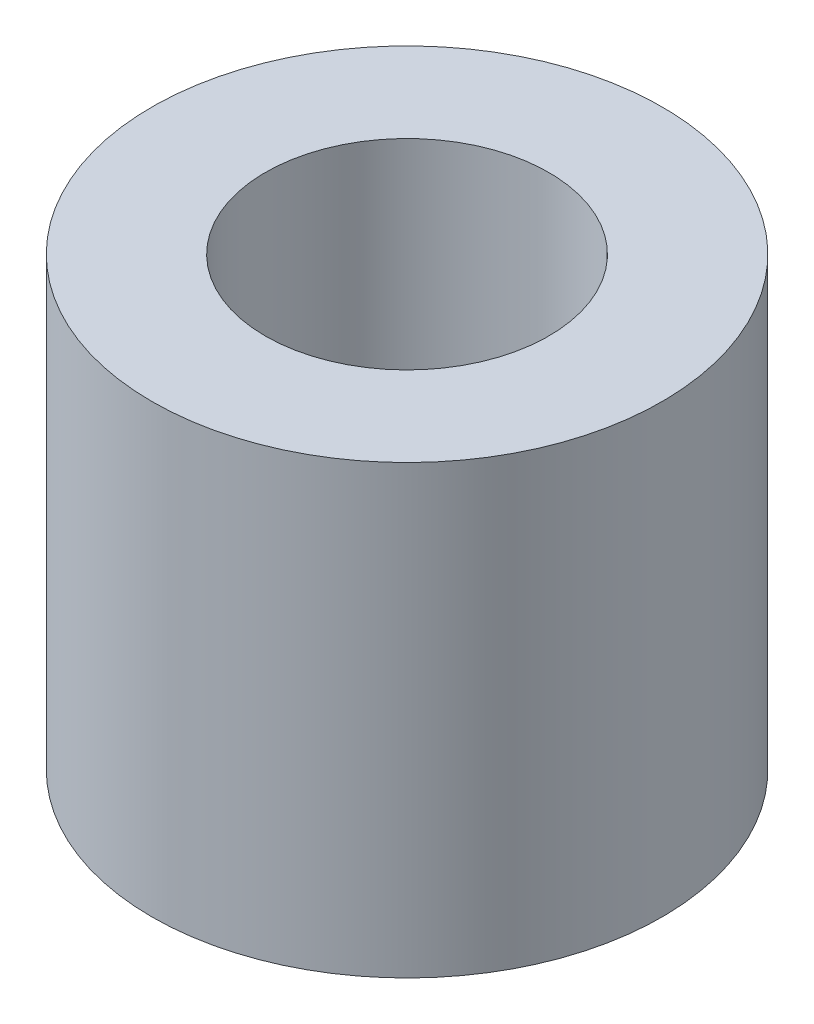
ISO-10303-21;
HEADER;
FILE_DESCRIPTION(('STEP AP214'),'2;1');
FILE_NAME('part.step','',(''),(''),'','','');
FILE_SCHEMA(('AUTOMOTIVE_DESIGN { 1 0 10303 214 1 1 1 1 }'));
ENDSEC;
DATA;
#1=APPLICATION_CONTEXT('core data for automotive mechanical design processes');
#2=APPLICATION_PROTOCOL_DEFINITION('international standard','automotive_design',2000,#1);
#3=PRODUCT_CONTEXT('',#1,'mechanical');
#4=PRODUCT('Part','Part','',(#3));
#5=PRODUCT_RELATED_PRODUCT_CATEGORY('part','',(#4));
#6=PRODUCT_DEFINITION_FORMATION('','',#4);
#7=PRODUCT_DEFINITION_CONTEXT('part definition',#1,'design');
#8=PRODUCT_DEFINITION('design','',#6,#7);
#9=PRODUCT_DEFINITION_SHAPE('','',#8);
#10=(LENGTH_UNIT() NAMED_UNIT(*) SI_UNIT(.MILLI.,.METRE.));
#11=(NAMED_UNIT(*) PLANE_ANGLE_UNIT() SI_UNIT($,.RADIAN.));
#12=(NAMED_UNIT(*) SI_UNIT($,.STERADIAN.) SOLID_ANGLE_UNIT());
#13=UNCERTAINTY_MEASURE_WITH_UNIT(LENGTH_MEASURE(1.E-05),#10,'distance_accuracy_value','');
#14=(GEOMETRIC_REPRESENTATION_CONTEXT(3) GLOBAL_UNCERTAINTY_ASSIGNED_CONTEXT((#13)) GLOBAL_UNIT_ASSIGNED_CONTEXT((#10,
#11,#12)) REPRESENTATION_CONTEXT('',''));
#15=CARTESIAN_POINT('',(0.,0.,0.));
#16=DIRECTION('',(0.,0.,1.));
#17=DIRECTION('',(1.,0.,0.));
#18=AXIS2_PLACEMENT_3D('',#15,#16,#17);
#19=CARTESIAN_POINT('',(0.,10.,0.));
#20=DIRECTION('',(0.,1.,0.));
#21=DIRECTION('',(0.,0.,1.));
#22=AXIS2_PLACEMENT_3D('',#19,#20,#21);
#23=PLANE('',#22);
#24=CARTESIAN_POINT('',(0.,10.,0.));
#25=DIRECTION('',(0.,1.,0.));
#26=DIRECTION('',(0.,0.,1.));
#27=AXIS2_PLACEMENT_3D('',#24,#25,#26);
#28=CIRCLE('',#27,5.715);
#29=CARTESIAN_POINT('',(0.,10.,5.715));
#30=VERTEX_POINT('',#29);
#31=EDGE_CURVE('E10',#30,#30,#28,.T.);
#32=ORIENTED_EDGE('',*,*,#31,.T.);
#33=EDGE_LOOP('',(#32));
#34=FACE_BOUND('',#33,.T.);
#35=CARTESIAN_POINT('',(0.,10.,0.));
#36=DIRECTION('',(0.,1.,0.));
#37=DIRECTION('',(0.,0.,1.));
#38=AXIS2_PLACEMENT_3D('',#35,#36,#37);
#39=CIRCLE('',#38,3.175);
#40=CARTESIAN_POINT('',(0.,10.,3.175));
#41=VERTEX_POINT('',#40);
#42=EDGE_CURVE('E46',#41,#41,#39,.T.);
#43=ORIENTED_EDGE('',*,*,#42,.F.);
#44=EDGE_LOOP('',(#43));
#45=FACE_BOUND('',#44,.T.);
#46=ADVANCED_FACE('F35',(#34,#45),#23,.T.);
#47=CARTESIAN_POINT('',(0.,0.,0.));
#48=DIRECTION('',(0.,1.,0.));
#49=DIRECTION('',(0.,0.,1.));
#50=AXIS2_PLACEMENT_3D('',#47,#48,#49);
#51=PLANE('',#50);
#52=CARTESIAN_POINT('',(0.,0.,0.));
#53=DIRECTION('',(0.,1.,0.));
#54=DIRECTION('',(0.,0.,1.));
#55=AXIS2_PLACEMENT_3D('',#52,#53,#54);
#56=CIRCLE('',#55,5.715);
#57=CARTESIAN_POINT('',(0.,0.,5.715));
#58=VERTEX_POINT('',#57);
#59=EDGE_CURVE('E39',#58,#58,#56,.T.);
#60=ORIENTED_EDGE('',*,*,#59,.F.);
#61=EDGE_LOOP('',(#60));
#62=FACE_BOUND('',#61,.T.);
#63=CARTESIAN_POINT('',(0.,0.,0.));
#64=DIRECTION('',(0.,1.,0.));
#65=DIRECTION('',(0.,0.,1.));
#66=AXIS2_PLACEMENT_3D('',#63,#64,#65);
#67=CIRCLE('',#66,3.175);
#68=CARTESIAN_POINT('',(0.,0.,3.175));
#69=VERTEX_POINT('',#68);
#70=EDGE_CURVE('E48',#69,#69,#67,.T.);
#71=ORIENTED_EDGE('',*,*,#70,.T.);
#72=EDGE_LOOP('',(#71));
#73=FACE_BOUND('',#72,.T.);
#74=ADVANCED_FACE('F58',(#62,#73),#51,.F.);
#75=CARTESIAN_POINT('',(0.,10.,0.));
#76=DIRECTION('',(0.,-1.,0.));
#77=DIRECTION('',(0.,0.,-1.));
#78=AXIS2_PLACEMENT_3D('',#75,#76,#77);
#79=CYLINDRICAL_SURFACE('',#78,5.715);
#80=ORIENTED_EDGE('',*,*,#31,.F.);
#81=EDGE_LOOP('',(#80));
#82=FACE_BOUND('',#81,.T.);
#83=ORIENTED_EDGE('',*,*,#59,.T.);
#84=EDGE_LOOP('',(#83));
#85=FACE_BOUND('',#84,.T.);
#86=ADVANCED_FACE('F37',(#82,#85),#79,.T.);
#87=CARTESIAN_POINT('',(0.,10.,0.));
#88=DIRECTION('',(0.,-1.,0.));
#89=DIRECTION('',(0.,0.,-1.));
#90=AXIS2_PLACEMENT_3D('',#87,#88,#89);
#91=CYLINDRICAL_SURFACE('',#90,3.175);
#92=ORIENTED_EDGE('',*,*,#42,.T.);
#93=EDGE_LOOP('',(#92));
#94=FACE_BOUND('',#93,.T.);
#95=ORIENTED_EDGE('',*,*,#70,.F.);
#96=EDGE_LOOP('',(#95));
#97=FACE_BOUND('',#96,.T.);
#98=ADVANCED_FACE('F54',(#94,#97),#91,.F.);
#99=CLOSED_SHELL('',(#46,#74,#86,#98));
#100=MANIFOLD_SOLID_BREP('B2',#99);
#101=ADVANCED_BREP_SHAPE_REPRESENTATION('',(#18,#100),#14);
#102=SHAPE_DEFINITION_REPRESENTATION(#9,#101);
ENDSEC;
END-ISO-10303-21;
